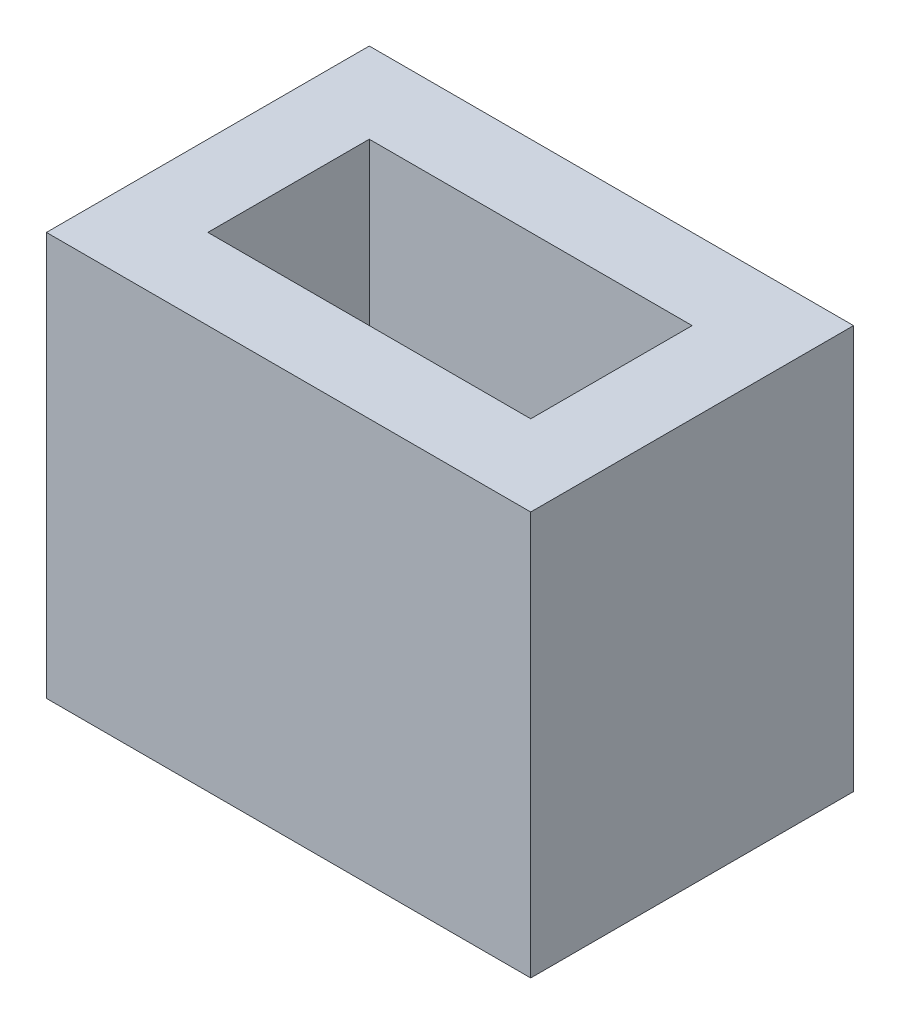
ISO-10303-21;
HEADER;
FILE_DESCRIPTION(('STEP AP214'),'2;1');
FILE_NAME('part.step','',(''),(''),'','','');
FILE_SCHEMA(('AUTOMOTIVE_DESIGN { 1 0 10303 214 1 1 1 1 }'));
ENDSEC;
DATA;
#1=APPLICATION_CONTEXT('core data for automotive mechanical design processes');
#2=APPLICATION_PROTOCOL_DEFINITION('international standard','automotive_design',2000,#1);
#3=PRODUCT_CONTEXT('',#1,'mechanical');
#4=PRODUCT('Part','Part','',(#3));
#5=PRODUCT_RELATED_PRODUCT_CATEGORY('part','',(#4));
#6=PRODUCT_DEFINITION_FORMATION('','',#4);
#7=PRODUCT_DEFINITION_CONTEXT('part definition',#1,'design');
#8=PRODUCT_DEFINITION('design','',#6,#7);
#9=PRODUCT_DEFINITION_SHAPE('','',#8);
#10=(LENGTH_UNIT() NAMED_UNIT(*) SI_UNIT(.MILLI.,.METRE.));
#11=(NAMED_UNIT(*) PLANE_ANGLE_UNIT() SI_UNIT($,.RADIAN.));
#12=(NAMED_UNIT(*) SI_UNIT($,.STERADIAN.) SOLID_ANGLE_UNIT());
#13=UNCERTAINTY_MEASURE_WITH_UNIT(LENGTH_MEASURE(1.E-05),#10,'distance_accuracy_value','');
#14=(GEOMETRIC_REPRESENTATION_CONTEXT(3) GLOBAL_UNCERTAINTY_ASSIGNED_CONTEXT((#13)) GLOBAL_UNIT_ASSIGNED_CONTEXT((#10,
#11,#12)) REPRESENTATION_CONTEXT('',''));
#15=CARTESIAN_POINT('',(0.,0.,0.));
#16=DIRECTION('',(0.,0.,1.));
#17=DIRECTION('',(1.,0.,0.));
#18=AXIS2_PLACEMENT_3D('',#15,#16,#17);
#19=CARTESIAN_POINT('',(6.,10.,4.));
#20=DIRECTION('',(0.,1.,0.));
#21=DIRECTION('',(0.,0.,1.));
#22=AXIS2_PLACEMENT_3D('',#19,#20,#21);
#23=PLANE('',#22);
#24=DIRECTION('',(0.,0.,-1.));
#25=VECTOR('',#24,1.);
#26=CARTESIAN_POINT('',(6.,10.,-4.));
#27=LINE('',#26,#25);
#28=CARTESIAN_POINT('',(6.,10.,4.));
#29=VERTEX_POINT('',#28);
#30=CARTESIAN_POINT('',(6.,10.,-4.));
#31=VERTEX_POINT('',#30);
#32=EDGE_CURVE('E132',#29,#31,#27,.T.);
#33=ORIENTED_EDGE('',*,*,#32,.T.);
#34=DIRECTION('',(-1.,0.,0.));
#35=VECTOR('',#34,1.);
#36=CARTESIAN_POINT('',(-6.,10.,-4.));
#37=LINE('',#36,#35);
#38=CARTESIAN_POINT('',(-6.,10.,-4.));
#39=VERTEX_POINT('',#38);
#40=EDGE_CURVE('E135',#31,#39,#37,.T.);
#41=ORIENTED_EDGE('',*,*,#40,.T.);
#42=DIRECTION('',(0.,0.,1.));
#43=VECTOR('',#42,1.);
#44=CARTESIAN_POINT('',(-6.,10.,-4.));
#45=LINE('',#44,#43);
#46=CARTESIAN_POINT('',(-6.,10.,4.));
#47=VERTEX_POINT('',#46);
#48=EDGE_CURVE('E138',#39,#47,#45,.T.);
#49=ORIENTED_EDGE('',*,*,#48,.T.);
#50=DIRECTION('',(1.,0.,0.));
#51=VECTOR('',#50,1.);
#52=CARTESIAN_POINT('',(-6.,10.,4.));
#53=LINE('',#52,#51);
#54=EDGE_CURVE('E140',#47,#29,#53,.T.);
#55=ORIENTED_EDGE('',*,*,#54,.T.);
#56=EDGE_LOOP('',(#33,#41,#49,#55));
#57=FACE_BOUND('',#56,.T.);
#58=DIRECTION('',(-1.,0.,0.));
#59=VECTOR('',#58,1.);
#60=CARTESIAN_POINT('',(-4.,10.,-2.));
#61=LINE('',#60,#59);
#62=CARTESIAN_POINT('',(4.,10.,-2.));
#63=VERTEX_POINT('',#62);
#64=CARTESIAN_POINT('',(-4.,10.,-2.));
#65=VERTEX_POINT('',#64);
#66=EDGE_CURVE('E104',#63,#65,#61,.T.);
#67=ORIENTED_EDGE('',*,*,#66,.F.);
#68=DIRECTION('',(0.,0.,-1.));
#69=VECTOR('',#68,1.);
#70=CARTESIAN_POINT('',(4.,10.,-2.));
#71=LINE('',#70,#69);
#72=CARTESIAN_POINT('',(4.,10.,2.));
#73=VERTEX_POINT('',#72);
#74=EDGE_CURVE('E96',#73,#63,#71,.T.);
#75=ORIENTED_EDGE('',*,*,#74,.F.);
#76=DIRECTION('',(1.,0.,0.));
#77=VECTOR('',#76,1.);
#78=CARTESIAN_POINT('',(-4.,10.,2.));
#79=LINE('',#78,#77);
#80=CARTESIAN_POINT('',(-4.,10.,2.));
#81=VERTEX_POINT('',#80);
#82=EDGE_CURVE('E118',#81,#73,#79,.T.);
#83=ORIENTED_EDGE('',*,*,#82,.F.);
#84=DIRECTION('',(0.,0.,1.));
#85=VECTOR('',#84,1.);
#86=CARTESIAN_POINT('',(-4.,10.,-2.));
#87=LINE('',#86,#85);
#88=EDGE_CURVE('E116',#65,#81,#87,.T.);
#89=ORIENTED_EDGE('',*,*,#88,.F.);
#90=EDGE_LOOP('',(#67,#75,#83,#89));
#91=FACE_BOUND('',#90,.T.);
#92=ADVANCED_FACE('F31',(#57,#91),#23,.T.);
#93=CARTESIAN_POINT('',(6.,0.,4.));
#94=DIRECTION('',(0.,1.,0.));
#95=DIRECTION('',(0.,0.,1.));
#96=AXIS2_PLACEMENT_3D('',#93,#94,#95);
#97=PLANE('',#96);
#98=DIRECTION('',(0.,0.,-1.));
#99=VECTOR('',#98,1.);
#100=CARTESIAN_POINT('',(6.,0.,-4.));
#101=LINE('',#100,#99);
#102=CARTESIAN_POINT('',(6.,0.,4.));
#103=VERTEX_POINT('',#102);
#104=CARTESIAN_POINT('',(6.,0.,-4.));
#105=VERTEX_POINT('',#104);
#106=EDGE_CURVE('E112',#103,#105,#101,.T.);
#107=ORIENTED_EDGE('',*,*,#106,.F.);
#108=DIRECTION('',(1.,0.,0.));
#109=VECTOR('',#108,1.);
#110=CARTESIAN_POINT('',(-6.,0.,4.));
#111=LINE('',#110,#109);
#112=CARTESIAN_POINT('',(-6.,0.,4.));
#113=VERTEX_POINT('',#112);
#114=EDGE_CURVE('E136',#113,#103,#111,.T.);
#115=ORIENTED_EDGE('',*,*,#114,.F.);
#116=DIRECTION('',(0.,0.,1.));
#117=VECTOR('',#116,1.);
#118=CARTESIAN_POINT('',(-6.,0.,-4.));
#119=LINE('',#118,#117);
#120=CARTESIAN_POINT('',(-6.,0.,-4.));
#121=VERTEX_POINT('',#120);
#122=EDGE_CURVE('E147',#121,#113,#119,.T.);
#123=ORIENTED_EDGE('',*,*,#122,.F.);
#124=DIRECTION('',(-1.,0.,0.));
#125=VECTOR('',#124,1.);
#126=CARTESIAN_POINT('',(-6.,0.,-4.));
#127=LINE('',#126,#125);
#128=EDGE_CURVE('E145',#105,#121,#127,.T.);
#129=ORIENTED_EDGE('',*,*,#128,.F.);
#130=EDGE_LOOP('',(#107,#115,#123,#129));
#131=FACE_BOUND('',#130,.T.);
#132=DIRECTION('',(0.,0.,-1.));
#133=VECTOR('',#132,1.);
#134=CARTESIAN_POINT('',(4.,0.,-2.));
#135=LINE('',#134,#133);
#136=CARTESIAN_POINT('',(4.,0.,2.));
#137=VERTEX_POINT('',#136);
#138=CARTESIAN_POINT('',(4.,0.,-2.));
#139=VERTEX_POINT('',#138);
#140=EDGE_CURVE('E54',#137,#139,#135,.T.);
#141=ORIENTED_EDGE('',*,*,#140,.T.);
#142=DIRECTION('',(-1.,0.,0.));
#143=VECTOR('',#142,1.);
#144=CARTESIAN_POINT('',(-4.,0.,-2.));
#145=LINE('',#144,#143);
#146=CARTESIAN_POINT('',(-4.,0.,-2.));
#147=VERTEX_POINT('',#146);
#148=EDGE_CURVE('E111',#139,#147,#145,.T.);
#149=ORIENTED_EDGE('',*,*,#148,.T.);
#150=DIRECTION('',(0.,0.,1.));
#151=VECTOR('',#150,1.);
#152=CARTESIAN_POINT('',(-4.,0.,-2.));
#153=LINE('',#152,#151);
#154=CARTESIAN_POINT('',(-4.,0.,2.));
#155=VERTEX_POINT('',#154);
#156=EDGE_CURVE('E124',#147,#155,#153,.T.);
#157=ORIENTED_EDGE('',*,*,#156,.T.);
#158=DIRECTION('',(1.,0.,0.));
#159=VECTOR('',#158,1.);
#160=CARTESIAN_POINT('',(-4.,0.,2.));
#161=LINE('',#160,#159);
#162=EDGE_CURVE('E105',#155,#137,#161,.T.);
#163=ORIENTED_EDGE('',*,*,#162,.T.);
#164=EDGE_LOOP('',(#141,#149,#157,#163));
#165=FACE_BOUND('',#164,.T.);
#166=ADVANCED_FACE('F165',(#131,#165),#97,.F.);
#167=CARTESIAN_POINT('',(6.,10.,-4.));
#168=DIRECTION('',(-1.,0.,0.));
#169=DIRECTION('',(0.,0.,1.));
#170=AXIS2_PLACEMENT_3D('',#167,#168,#169);
#171=PLANE('',#170);
#172=ORIENTED_EDGE('',*,*,#106,.T.);
#173=DIRECTION('',(0.,-1.,0.));
#174=VECTOR('',#173,1.);
#175=CARTESIAN_POINT('',(6.,10.,-4.));
#176=LINE('',#175,#174);
#177=EDGE_CURVE('E11',#31,#105,#176,.T.);
#178=ORIENTED_EDGE('',*,*,#177,.F.);
#179=ORIENTED_EDGE('',*,*,#32,.F.);
#180=DIRECTION('',(0.,-1.,0.));
#181=VECTOR('',#180,1.);
#182=CARTESIAN_POINT('',(6.,10.,4.));
#183=LINE('',#182,#181);
#184=EDGE_CURVE('E142',#29,#103,#183,.T.);
#185=ORIENTED_EDGE('',*,*,#184,.T.);
#186=EDGE_LOOP('',(#172,#178,#179,#185));
#187=FACE_BOUND('',#186,.T.);
#188=ADVANCED_FACE('F33',(#187),#171,.F.);
#189=CARTESIAN_POINT('',(-6.,10.,-4.));
#190=DIRECTION('',(0.,0.,1.));
#191=DIRECTION('',(1.,0.,0.));
#192=AXIS2_PLACEMENT_3D('',#189,#190,#191);
#193=PLANE('',#192);
#194=ORIENTED_EDGE('',*,*,#128,.T.);
#195=DIRECTION('',(0.,-1.,0.));
#196=VECTOR('',#195,1.);
#197=CARTESIAN_POINT('',(-6.,10.,-4.));
#198=LINE('',#197,#196);
#199=EDGE_CURVE('E39',#39,#121,#198,.T.);
#200=ORIENTED_EDGE('',*,*,#199,.F.);
#201=ORIENTED_EDGE('',*,*,#40,.F.);
#202=ORIENTED_EDGE('',*,*,#177,.T.);
#203=EDGE_LOOP('',(#194,#200,#201,#202));
#204=FACE_BOUND('',#203,.T.);
#205=ADVANCED_FACE('F175',(#204),#193,.F.);
#206=CARTESIAN_POINT('',(-6.,10.,-4.));
#207=DIRECTION('',(1.,0.,0.));
#208=DIRECTION('',(0.,0.,-1.));
#209=AXIS2_PLACEMENT_3D('',#206,#207,#208);
#210=PLANE('',#209);
#211=ORIENTED_EDGE('',*,*,#122,.T.);
#212=DIRECTION('',(0.,-1.,0.));
#213=VECTOR('',#212,1.);
#214=CARTESIAN_POINT('',(-6.,10.,4.));
#215=LINE('',#214,#213);
#216=EDGE_CURVE('E152',#47,#113,#215,.T.);
#217=ORIENTED_EDGE('',*,*,#216,.F.);
#218=ORIENTED_EDGE('',*,*,#48,.F.);
#219=ORIENTED_EDGE('',*,*,#199,.T.);
#220=EDGE_LOOP('',(#211,#217,#218,#219));
#221=FACE_BOUND('',#220,.T.);
#222=ADVANCED_FACE('F159',(#221),#210,.F.);
#223=CARTESIAN_POINT('',(-6.,10.,4.));
#224=DIRECTION('',(0.,0.,-1.));
#225=DIRECTION('',(-1.,0.,0.));
#226=AXIS2_PLACEMENT_3D('',#223,#224,#225);
#227=PLANE('',#226);
#228=ORIENTED_EDGE('',*,*,#114,.T.);
#229=ORIENTED_EDGE('',*,*,#184,.F.);
#230=ORIENTED_EDGE('',*,*,#54,.F.);
#231=ORIENTED_EDGE('',*,*,#216,.T.);
#232=EDGE_LOOP('',(#228,#229,#230,#231));
#233=FACE_BOUND('',#232,.T.);
#234=ADVANCED_FACE('F169',(#233),#227,.F.);
#235=CARTESIAN_POINT('',(4.,10.,-2.));
#236=DIRECTION('',(-1.,0.,0.));
#237=DIRECTION('',(0.,0.,1.));
#238=AXIS2_PLACEMENT_3D('',#235,#236,#237);
#239=PLANE('',#238);
#240=ORIENTED_EDGE('',*,*,#140,.F.);
#241=DIRECTION('',(0.,-1.,0.));
#242=VECTOR('',#241,1.);
#243=CARTESIAN_POINT('',(4.,10.,2.));
#244=LINE('',#243,#242);
#245=EDGE_CURVE('E100',#73,#137,#244,.T.);
#246=ORIENTED_EDGE('',*,*,#245,.F.);
#247=ORIENTED_EDGE('',*,*,#74,.T.);
#248=DIRECTION('',(0.,-1.,0.));
#249=VECTOR('',#248,1.);
#250=CARTESIAN_POINT('',(4.,10.,-2.));
#251=LINE('',#250,#249);
#252=EDGE_CURVE('E99',#63,#139,#251,.T.);
#253=ORIENTED_EDGE('',*,*,#252,.T.);
#254=EDGE_LOOP('',(#240,#246,#247,#253));
#255=FACE_BOUND('',#254,.T.);
#256=ADVANCED_FACE('F98',(#255),#239,.T.);
#257=CARTESIAN_POINT('',(-4.,10.,-2.));
#258=DIRECTION('',(0.,0.,1.));
#259=DIRECTION('',(1.,0.,0.));
#260=AXIS2_PLACEMENT_3D('',#257,#258,#259);
#261=PLANE('',#260);
#262=ORIENTED_EDGE('',*,*,#148,.F.);
#263=ORIENTED_EDGE('',*,*,#252,.F.);
#264=ORIENTED_EDGE('',*,*,#66,.T.);
#265=DIRECTION('',(0.,-1.,0.));
#266=VECTOR('',#265,1.);
#267=CARTESIAN_POINT('',(-4.,10.,-2.));
#268=LINE('',#267,#266);
#269=EDGE_CURVE('E113',#65,#147,#268,.T.);
#270=ORIENTED_EDGE('',*,*,#269,.T.);
#271=EDGE_LOOP('',(#262,#263,#264,#270));
#272=FACE_BOUND('',#271,.T.);
#273=ADVANCED_FACE('F108',(#272),#261,.T.);
#274=CARTESIAN_POINT('',(-4.,10.,-2.));
#275=DIRECTION('',(1.,0.,0.));
#276=DIRECTION('',(0.,0.,-1.));
#277=AXIS2_PLACEMENT_3D('',#274,#275,#276);
#278=PLANE('',#277);
#279=ORIENTED_EDGE('',*,*,#156,.F.);
#280=ORIENTED_EDGE('',*,*,#269,.F.);
#281=ORIENTED_EDGE('',*,*,#88,.T.);
#282=DIRECTION('',(0.,-1.,0.));
#283=VECTOR('',#282,1.);
#284=CARTESIAN_POINT('',(-4.,10.,2.));
#285=LINE('',#284,#283);
#286=EDGE_CURVE('E46',#81,#155,#285,.T.);
#287=ORIENTED_EDGE('',*,*,#286,.T.);
#288=EDGE_LOOP('',(#279,#280,#281,#287));
#289=FACE_BOUND('',#288,.T.);
#290=ADVANCED_FACE('F198',(#289),#278,.T.);
#291=CARTESIAN_POINT('',(-4.,10.,2.));
#292=DIRECTION('',(0.,0.,-1.));
#293=DIRECTION('',(-1.,0.,0.));
#294=AXIS2_PLACEMENT_3D('',#291,#292,#293);
#295=PLANE('',#294);
#296=ORIENTED_EDGE('',*,*,#162,.F.);
#297=ORIENTED_EDGE('',*,*,#286,.F.);
#298=ORIENTED_EDGE('',*,*,#82,.T.);
#299=ORIENTED_EDGE('',*,*,#245,.T.);
#300=EDGE_LOOP('',(#296,#297,#298,#299));
#301=FACE_BOUND('',#300,.T.);
#302=ADVANCED_FACE('F202',(#301),#295,.T.);
#303=CLOSED_SHELL('',(#92,#166,#188,#205,#222,#234,#256,#273,#290,#302));
#304=MANIFOLD_SOLID_BREP('B2',#303);
#305=ADVANCED_BREP_SHAPE_REPRESENTATION('',(#18,#304),#14);
#306=SHAPE_DEFINITION_REPRESENTATION(#9,#305);
ENDSEC;
END-ISO-10303-21;
